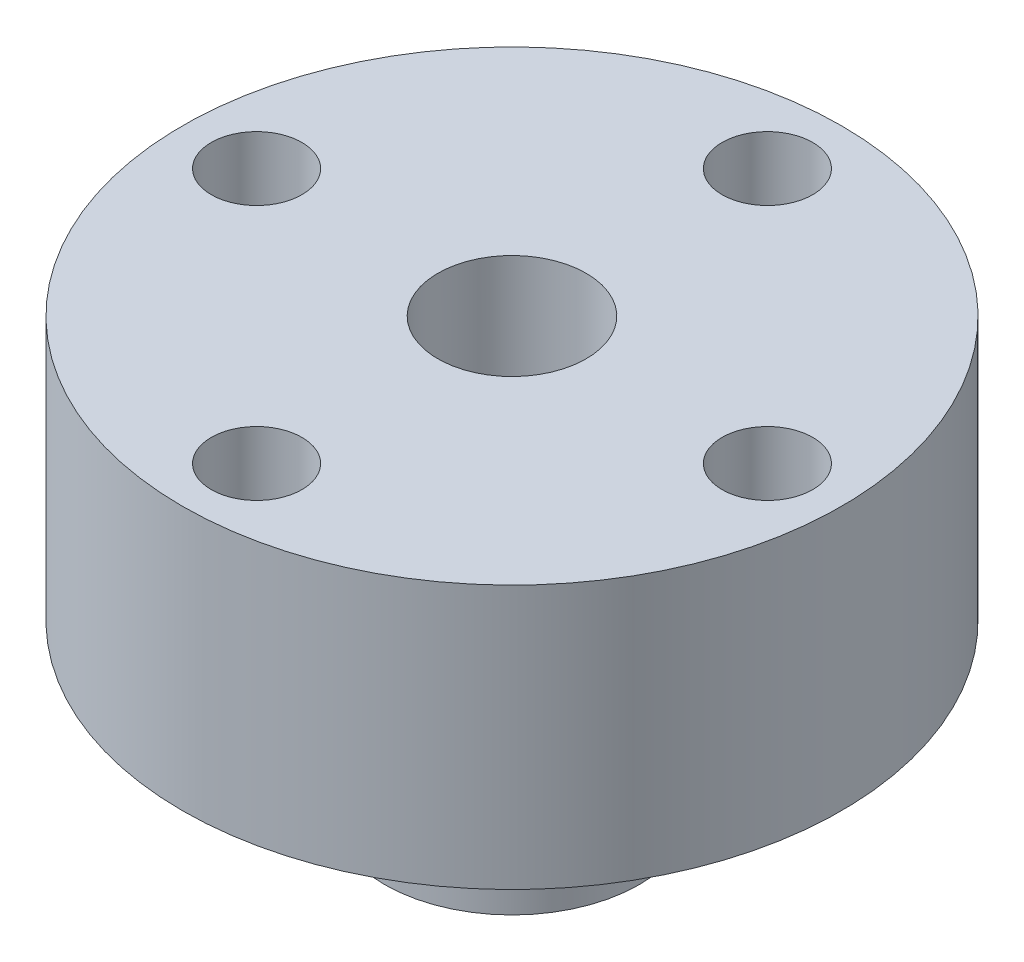
ISO-10303-21;
HEADER;
FILE_DESCRIPTION(('STEP AP214'),'2;1');
FILE_NAME('part.step','',(''),(''),'','','');
FILE_SCHEMA(('AUTOMOTIVE_DESIGN { 1 0 10303 214 1 1 1 1 }'));
ENDSEC;
DATA;
#1=APPLICATION_CONTEXT('core data for automotive mechanical design processes');
#2=APPLICATION_PROTOCOL_DEFINITION('international standard','automotive_design',2000,#1);
#3=PRODUCT_CONTEXT('',#1,'mechanical');
#4=PRODUCT('Part','Part','',(#3));
#5=PRODUCT_RELATED_PRODUCT_CATEGORY('part','',(#4));
#6=PRODUCT_DEFINITION_FORMATION('','',#4);
#7=PRODUCT_DEFINITION_CONTEXT('part definition',#1,'design');
#8=PRODUCT_DEFINITION('design','',#6,#7);
#9=PRODUCT_DEFINITION_SHAPE('','',#8);
#10=(LENGTH_UNIT() NAMED_UNIT(*) SI_UNIT(.MILLI.,.METRE.));
#11=(NAMED_UNIT(*) PLANE_ANGLE_UNIT() SI_UNIT($,.RADIAN.));
#12=(NAMED_UNIT(*) SI_UNIT($,.STERADIAN.) SOLID_ANGLE_UNIT());
#13=UNCERTAINTY_MEASURE_WITH_UNIT(LENGTH_MEASURE(1.E-05),#10,'distance_accuracy_value','');
#14=(GEOMETRIC_REPRESENTATION_CONTEXT(3) GLOBAL_UNCERTAINTY_ASSIGNED_CONTEXT((#13)) GLOBAL_UNIT_ASSIGNED_CONTEXT((#10,
#11,#12)) REPRESENTATION_CONTEXT('',''));
#15=CARTESIAN_POINT('',(0.,0.,0.));
#16=DIRECTION('',(0.,0.,1.));
#17=DIRECTION('',(1.,0.,0.));
#18=AXIS2_PLACEMENT_3D('',#15,#16,#17);
#19=CARTESIAN_POINT('',(0.,24.2735064736294,0.));
#20=DIRECTION('',(0.,-1.,0.));
#21=DIRECTION('',(0.,0.,-1.));
#22=AXIS2_PLACEMENT_3D('',#19,#20,#21);
#23=CYLINDRICAL_SURFACE('',#22,5.4);
#24=CARTESIAN_POINT('',(0.,0.,0.));
#25=DIRECTION('',(0.,1.,0.));
#26=DIRECTION('',(0.,0.,1.));
#27=AXIS2_PLACEMENT_3D('',#24,#25,#26);
#28=CIRCLE('',#27,5.4);
#29=CARTESIAN_POINT('',(0.,0.,5.4));
#30=VERTEX_POINT('',#29);
#31=EDGE_CURVE('E84',#30,#30,#28,.T.);
#32=ORIENTED_EDGE('',*,*,#31,.T.);
#33=EDGE_LOOP('',(#32));
#34=FACE_BOUND('',#33,.T.);
#35=CARTESIAN_POINT('',(0.,0.999999999999997,0.));
#36=DIRECTION('',(0.,1.,0.));
#37=DIRECTION('',(0.,0.,1.));
#38=AXIS2_PLACEMENT_3D('',#35,#36,#37);
#39=CIRCLE('',#38,5.4);
#40=CARTESIAN_POINT('',(0.,0.999999999999997,5.4));
#41=VERTEX_POINT('',#40);
#42=EDGE_CURVE('E10',#41,#41,#39,.T.);
#43=ORIENTED_EDGE('',*,*,#42,.F.);
#44=EDGE_LOOP('',(#43));
#45=FACE_BOUND('',#44,.T.);
#46=ADVANCED_FACE('F33',(#34,#45),#23,.T.);
#47=CARTESIAN_POINT('',(0.,-4.,0.));
#48=DIRECTION('',(0.,1.,0.));
#49=DIRECTION('',(0.,0.,1.));
#50=AXIS2_PLACEMENT_3D('',#47,#48,#49);
#51=CYLINDRICAL_SURFACE('',#50,3.875);
#52=CARTESIAN_POINT('',(0.,-4.,0.));
#53=DIRECTION('',(0.,1.,0.));
#54=DIRECTION('',(0.,0.,1.));
#55=AXIS2_PLACEMENT_3D('',#52,#53,#54);
#56=CIRCLE('',#55,3.875);
#57=CARTESIAN_POINT('',(0.,-4.,3.875));
#58=VERTEX_POINT('',#57);
#59=EDGE_CURVE('E41',#58,#58,#56,.T.);
#60=ORIENTED_EDGE('',*,*,#59,.T.);
#61=EDGE_LOOP('',(#60));
#62=FACE_BOUND('',#61,.T.);
#63=CARTESIAN_POINT('',(0.,0.,0.));
#64=DIRECTION('',(0.,1.,0.));
#65=DIRECTION('',(0.,0.,1.));
#66=AXIS2_PLACEMENT_3D('',#63,#64,#65);
#67=CIRCLE('',#66,3.875);
#68=CARTESIAN_POINT('',(0.,0.,3.875));
#69=VERTEX_POINT('',#68);
#70=EDGE_CURVE('E46',#69,#69,#67,.F.);
#71=ORIENTED_EDGE('',*,*,#70,.T.);
#72=EDGE_LOOP('',(#71));
#73=FACE_BOUND('',#72,.T.);
#74=ADVANCED_FACE('F35',(#62,#73),#51,.T.);
#75=CARTESIAN_POINT('',(0.,-4.,0.));
#76=DIRECTION('',(0.,1.,0.));
#77=DIRECTION('',(0.,0.,1.));
#78=AXIS2_PLACEMENT_3D('',#75,#76,#77);
#79=PLANE('',#78);
#80=CARTESIAN_POINT('',(0.,-4.,0.));
#81=DIRECTION('',(0.,1.,0.));
#82=DIRECTION('',(0.,0.,1.));
#83=AXIS2_PLACEMENT_3D('',#80,#81,#82);
#84=CIRCLE('',#83,2.25);
#85=CARTESIAN_POINT('',(0.,-4.,2.25));
#86=VERTEX_POINT('',#85);
#87=EDGE_CURVE('E77',#86,#86,#84,.T.);
#88=ORIENTED_EDGE('',*,*,#87,.T.);
#89=EDGE_LOOP('',(#88));
#90=FACE_BOUND('',#89,.T.);
#91=ORIENTED_EDGE('',*,*,#59,.F.);
#92=EDGE_LOOP('',(#91));
#93=FACE_BOUND('',#92,.T.);
#94=ADVANCED_FACE('F98',(#90,#93),#79,.F.);
#95=CARTESIAN_POINT('',(0.,0.,0.));
#96=DIRECTION('',(0.,1.,0.));
#97=DIRECTION('',(0.,0.,1.));
#98=AXIS2_PLACEMENT_3D('',#95,#96,#97);
#99=PLANE('',#98);
#100=ORIENTED_EDGE('',*,*,#70,.F.);
#101=EDGE_LOOP('',(#100));
#102=FACE_BOUND('',#101,.T.);
#103=ORIENTED_EDGE('',*,*,#31,.F.);
#104=EDGE_LOOP('',(#103));
#105=FACE_BOUND('',#104,.T.);
#106=ADVANCED_FACE('F94',(#102,#105),#99,.F.);
#107=CARTESIAN_POINT('',(0.,0.999999999999999,0.));
#108=DIRECTION('',(0.,1.,0.));
#109=DIRECTION('',(0.,0.,1.));
#110=AXIS2_PLACEMENT_3D('',#107,#108,#109);
#111=CYLINDRICAL_SURFACE('',#110,10.);
#112=CARTESIAN_POINT('',(0.,0.999999999999999,0.));
#113=DIRECTION('',(0.,1.,0.));
#114=DIRECTION('',(0.,0.,1.));
#115=AXIS2_PLACEMENT_3D('',#112,#113,#114);
#116=CIRCLE('',#115,10.);
#117=CARTESIAN_POINT('',(0.,0.999999999999999,10.));
#118=VERTEX_POINT('',#117);
#119=EDGE_CURVE('E81',#118,#118,#116,.T.);
#120=ORIENTED_EDGE('',*,*,#119,.T.);
#121=EDGE_LOOP('',(#120));
#122=FACE_BOUND('',#121,.T.);
#123=CARTESIAN_POINT('',(0.,9.,0.));
#124=DIRECTION('',(0.,1.,0.));
#125=DIRECTION('',(0.,0.,1.));
#126=AXIS2_PLACEMENT_3D('',#123,#124,#125);
#127=CIRCLE('',#126,10.);
#128=CARTESIAN_POINT('',(0.,9.,10.));
#129=VERTEX_POINT('',#128);
#130=EDGE_CURVE('E80',#129,#129,#127,.T.);
#131=ORIENTED_EDGE('',*,*,#130,.F.);
#132=EDGE_LOOP('',(#131));
#133=FACE_BOUND('',#132,.T.);
#134=ADVANCED_FACE('F97',(#122,#133),#111,.T.);
#135=CARTESIAN_POINT('',(0.,0.999999999999999,0.));
#136=DIRECTION('',(0.,1.,0.));
#137=DIRECTION('',(0.,0.,1.));
#138=AXIS2_PLACEMENT_3D('',#135,#136,#137);
#139=PLANE('',#138);
#140=CARTESIAN_POINT('',(0.,0.999999999999999,7.75));
#141=DIRECTION('',(0.,1.,0.));
#142=DIRECTION('',(0.,0.,1.));
#143=AXIS2_PLACEMENT_3D('',#140,#141,#142);
#144=CIRCLE('',#143,1.375);
#145=CARTESIAN_POINT('',(0.,0.999999999999999,9.125));
#146=VERTEX_POINT('',#145);
#147=EDGE_CURVE('E54',#146,#146,#144,.T.);
#148=ORIENTED_EDGE('',*,*,#147,.T.);
#149=EDGE_LOOP('',(#148));
#150=FACE_BOUND('',#149,.T.);
#151=CARTESIAN_POINT('',(7.75,0.999999999999999,0.));
#152=DIRECTION('',(0.,1.,0.));
#153=DIRECTION('',(0.,0.,1.));
#154=AXIS2_PLACEMENT_3D('',#151,#152,#153);
#155=CIRCLE('',#154,1.375);
#156=CARTESIAN_POINT('',(7.75,0.999999999999999,1.375));
#157=VERTEX_POINT('',#156);
#158=EDGE_CURVE('E60',#157,#157,#155,.T.);
#159=ORIENTED_EDGE('',*,*,#158,.T.);
#160=EDGE_LOOP('',(#159));
#161=FACE_BOUND('',#160,.T.);
#162=CARTESIAN_POINT('',(0.,0.999999999999999,-7.75));
#163=DIRECTION('',(0.,1.,0.));
#164=DIRECTION('',(0.,0.,1.));
#165=AXIS2_PLACEMENT_3D('',#162,#163,#164);
#166=CIRCLE('',#165,1.375);
#167=CARTESIAN_POINT('',(0.,0.999999999999999,-6.375));
#168=VERTEX_POINT('',#167);
#169=EDGE_CURVE('E57',#168,#168,#166,.T.);
#170=ORIENTED_EDGE('',*,*,#169,.T.);
#171=EDGE_LOOP('',(#170));
#172=FACE_BOUND('',#171,.T.);
#173=CARTESIAN_POINT('',(-7.75,0.999999999999999,0.));
#174=DIRECTION('',(0.,1.,0.));
#175=DIRECTION('',(0.,0.,1.));
#176=AXIS2_PLACEMENT_3D('',#173,#174,#175);
#177=CIRCLE('',#176,1.375);
#178=CARTESIAN_POINT('',(-7.75,0.999999999999999,1.375));
#179=VERTEX_POINT('',#178);
#180=EDGE_CURVE('E53',#179,#179,#177,.T.);
#181=ORIENTED_EDGE('',*,*,#180,.T.);
#182=EDGE_LOOP('',(#181));
#183=FACE_BOUND('',#182,.T.);
#184=ORIENTED_EDGE('',*,*,#42,.T.);
#185=EDGE_LOOP('',(#184));
#186=FACE_BOUND('',#185,.T.);
#187=ORIENTED_EDGE('',*,*,#119,.F.);
#188=EDGE_LOOP('',(#187));
#189=FACE_BOUND('',#188,.T.);
#190=ADVANCED_FACE('F104',(#150,#161,#172,#183,#186,#189),#139,.F.);
#191=CARTESIAN_POINT('',(0.,9.,0.));
#192=DIRECTION('',(0.,1.,0.));
#193=DIRECTION('',(0.,0.,1.));
#194=AXIS2_PLACEMENT_3D('',#191,#192,#193);
#195=PLANE('',#194);
#196=CARTESIAN_POINT('',(0.,9.,7.75));
#197=DIRECTION('',(0.,1.,0.));
#198=DIRECTION('',(0.,0.,1.));
#199=AXIS2_PLACEMENT_3D('',#196,#197,#198);
#200=CIRCLE('',#199,1.375);
#201=CARTESIAN_POINT('',(0.,9.,9.125));
#202=VERTEX_POINT('',#201);
#203=EDGE_CURVE('E37',#202,#202,#200,.T.);
#204=ORIENTED_EDGE('',*,*,#203,.F.);
#205=EDGE_LOOP('',(#204));
#206=FACE_BOUND('',#205,.T.);
#207=CARTESIAN_POINT('',(7.75,9.,0.));
#208=DIRECTION('',(0.,1.,0.));
#209=DIRECTION('',(0.,0.,1.));
#210=AXIS2_PLACEMENT_3D('',#207,#208,#209);
#211=CIRCLE('',#210,1.375);
#212=CARTESIAN_POINT('',(7.75,9.,1.375));
#213=VERTEX_POINT('',#212);
#214=EDGE_CURVE('E58',#213,#213,#211,.T.);
#215=ORIENTED_EDGE('',*,*,#214,.F.);
#216=EDGE_LOOP('',(#215));
#217=FACE_BOUND('',#216,.T.);
#218=CARTESIAN_POINT('',(0.,9.,-7.75));
#219=DIRECTION('',(0.,1.,0.));
#220=DIRECTION('',(0.,0.,1.));
#221=AXIS2_PLACEMENT_3D('',#218,#219,#220);
#222=CIRCLE('',#221,1.375);
#223=CARTESIAN_POINT('',(0.,9.,-6.375));
#224=VERTEX_POINT('',#223);
#225=EDGE_CURVE('E55',#224,#224,#222,.T.);
#226=ORIENTED_EDGE('',*,*,#225,.F.);
#227=EDGE_LOOP('',(#226));
#228=FACE_BOUND('',#227,.T.);
#229=CARTESIAN_POINT('',(-7.75,9.,0.));
#230=DIRECTION('',(0.,1.,0.));
#231=DIRECTION('',(0.,0.,1.));
#232=AXIS2_PLACEMENT_3D('',#229,#230,#231);
#233=CIRCLE('',#232,1.375);
#234=CARTESIAN_POINT('',(-7.75,9.,1.375));
#235=VERTEX_POINT('',#234);
#236=EDGE_CURVE('E50',#235,#235,#233,.T.);
#237=ORIENTED_EDGE('',*,*,#236,.F.);
#238=EDGE_LOOP('',(#237));
#239=FACE_BOUND('',#238,.T.);
#240=CARTESIAN_POINT('',(0.,9.,0.));
#241=DIRECTION('',(0.,-1.,0.));
#242=DIRECTION('',(0.,0.,-1.));
#243=AXIS2_PLACEMENT_3D('',#240,#241,#242);
#244=CIRCLE('',#243,2.25);
#245=CARTESIAN_POINT('',(0.,9.,-2.25));
#246=VERTEX_POINT('',#245);
#247=EDGE_CURVE('E74',#246,#246,#244,.T.);
#248=ORIENTED_EDGE('',*,*,#247,.T.);
#249=EDGE_LOOP('',(#248));
#250=FACE_BOUND('',#249,.T.);
#251=ORIENTED_EDGE('',*,*,#130,.T.);
#252=EDGE_LOOP('',(#251));
#253=FACE_BOUND('',#252,.T.);
#254=ADVANCED_FACE('F116',(#206,#217,#228,#239,#250,#253),#195,.T.);
#255=CARTESIAN_POINT('',(0.,9.,0.));
#256=DIRECTION('',(0.,-1.,0.));
#257=DIRECTION('',(0.,0.,-1.));
#258=AXIS2_PLACEMENT_3D('',#255,#256,#257);
#259=CYLINDRICAL_SURFACE('',#258,2.25);
#260=ORIENTED_EDGE('',*,*,#247,.F.);
#261=EDGE_LOOP('',(#260));
#262=FACE_BOUND('',#261,.T.);
#263=ORIENTED_EDGE('',*,*,#87,.F.);
#264=EDGE_LOOP('',(#263));
#265=FACE_BOUND('',#264,.T.);
#266=ADVANCED_FACE('F118',(#262,#265),#259,.F.);
#267=CARTESIAN_POINT('',(-7.75,-3.88908729652601,0.));
#268=DIRECTION('',(0.,1.,0.));
#269=DIRECTION('',(0.,0.,1.));
#270=AXIS2_PLACEMENT_3D('',#267,#268,#269);
#271=CYLINDRICAL_SURFACE('',#270,1.375);
#272=ORIENTED_EDGE('',*,*,#236,.T.);
#273=EDGE_LOOP('',(#272));
#274=FACE_BOUND('',#273,.T.);
#275=ORIENTED_EDGE('',*,*,#180,.F.);
#276=EDGE_LOOP('',(#275));
#277=FACE_BOUND('',#276,.T.);
#278=ADVANCED_FACE('F124',(#274,#277),#271,.F.);
#279=CARTESIAN_POINT('',(0.,-3.88908729652601,-7.75));
#280=DIRECTION('',(0.,1.,0.));
#281=DIRECTION('',(0.,0.,1.));
#282=AXIS2_PLACEMENT_3D('',#279,#280,#281);
#283=CYLINDRICAL_SURFACE('',#282,1.375);
#284=ORIENTED_EDGE('',*,*,#225,.T.);
#285=EDGE_LOOP('',(#284));
#286=FACE_BOUND('',#285,.T.);
#287=ORIENTED_EDGE('',*,*,#169,.F.);
#288=EDGE_LOOP('',(#287));
#289=FACE_BOUND('',#288,.T.);
#290=ADVANCED_FACE('F148',(#286,#289),#283,.F.);
#291=CARTESIAN_POINT('',(7.75,-3.88908729652601,0.));
#292=DIRECTION('',(0.,1.,0.));
#293=DIRECTION('',(0.,0.,1.));
#294=AXIS2_PLACEMENT_3D('',#291,#292,#293);
#295=CYLINDRICAL_SURFACE('',#294,1.375);
#296=ORIENTED_EDGE('',*,*,#214,.T.);
#297=EDGE_LOOP('',(#296));
#298=FACE_BOUND('',#297,.T.);
#299=ORIENTED_EDGE('',*,*,#158,.F.);
#300=EDGE_LOOP('',(#299));
#301=FACE_BOUND('',#300,.T.);
#302=ADVANCED_FACE('F157',(#298,#301),#295,.F.);
#303=CARTESIAN_POINT('',(0.,-3.88908729652601,7.75));
#304=DIRECTION('',(0.,1.,0.));
#305=DIRECTION('',(0.,0.,1.));
#306=AXIS2_PLACEMENT_3D('',#303,#304,#305);
#307=CYLINDRICAL_SURFACE('',#306,1.375);
#308=ORIENTED_EDGE('',*,*,#203,.T.);
#309=EDGE_LOOP('',(#308));
#310=FACE_BOUND('',#309,.T.);
#311=ORIENTED_EDGE('',*,*,#147,.F.);
#312=EDGE_LOOP('',(#311));
#313=FACE_BOUND('',#312,.T.);
#314=ADVANCED_FACE('F163',(#310,#313),#307,.F.);
#315=CLOSED_SHELL('',(#46,#74,#94,#106,#134,#190,#254,#266,#278,#290,#302,#314));
#316=MANIFOLD_SOLID_BREP('B2',#315);
#317=ADVANCED_BREP_SHAPE_REPRESENTATION('',(#18,#316),#14);
#318=SHAPE_DEFINITION_REPRESENTATION(#9,#317);
ENDSEC;
END-ISO-10303-21;
